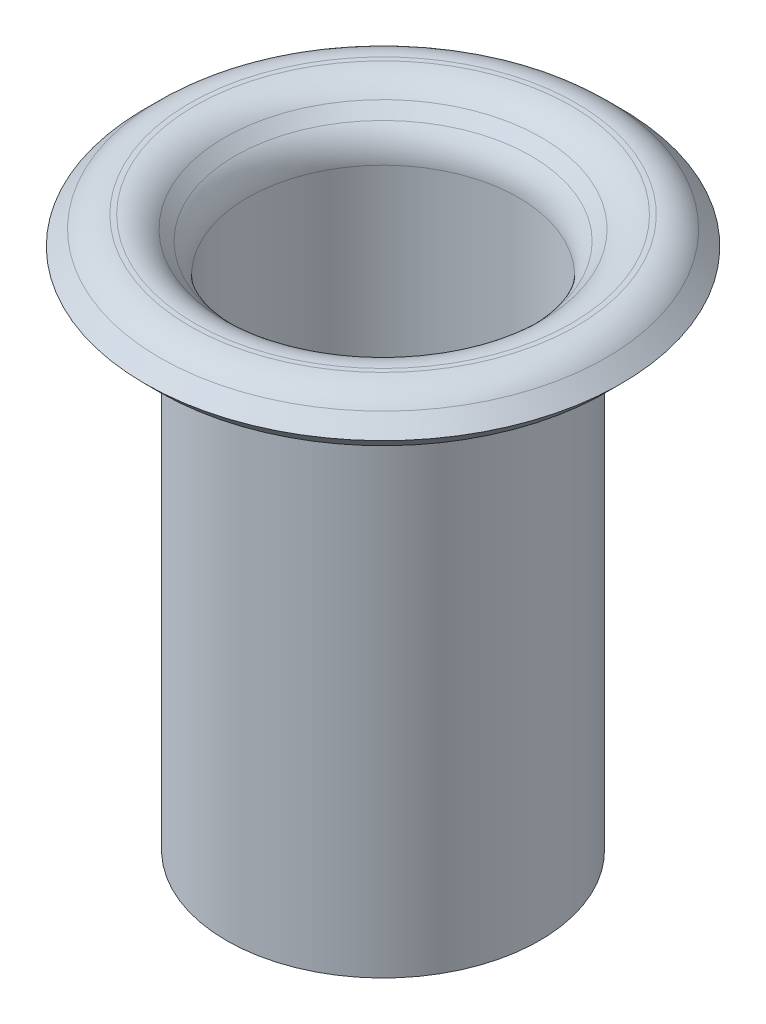
ISO-10303-21;
HEADER;
FILE_DESCRIPTION(('STEP AP214'),'2;1');
FILE_NAME('part.step','',(''),(''),'','','');
FILE_SCHEMA(('AUTOMOTIVE_DESIGN { 1 0 10303 214 1 1 1 1 }'));
ENDSEC;
DATA;
#1=APPLICATION_CONTEXT('core data for automotive mechanical design processes');
#2=APPLICATION_PROTOCOL_DEFINITION('international standard','automotive_design',2000,#1);
#3=PRODUCT_CONTEXT('',#1,'mechanical');
#4=PRODUCT('Part','Part','',(#3));
#5=PRODUCT_RELATED_PRODUCT_CATEGORY('part','',(#4));
#6=PRODUCT_DEFINITION_FORMATION('','',#4);
#7=PRODUCT_DEFINITION_CONTEXT('part definition',#1,'design');
#8=PRODUCT_DEFINITION('design','',#6,#7);
#9=PRODUCT_DEFINITION_SHAPE('','',#8);
#10=(LENGTH_UNIT() NAMED_UNIT(*) SI_UNIT(.MILLI.,.METRE.));
#11=(NAMED_UNIT(*) PLANE_ANGLE_UNIT() SI_UNIT($,.RADIAN.));
#12=(NAMED_UNIT(*) SI_UNIT($,.STERADIAN.) SOLID_ANGLE_UNIT());
#13=UNCERTAINTY_MEASURE_WITH_UNIT(LENGTH_MEASURE(1.E-05),#10,'distance_accuracy_value','');
#14=(GEOMETRIC_REPRESENTATION_CONTEXT(3) GLOBAL_UNCERTAINTY_ASSIGNED_CONTEXT((#13)) GLOBAL_UNIT_ASSIGNED_CONTEXT((#10,
#11,#12)) REPRESENTATION_CONTEXT('',''));
#15=CARTESIAN_POINT('',(0.,0.,0.));
#16=DIRECTION('',(0.,0.,1.));
#17=DIRECTION('',(1.,0.,0.));
#18=AXIS2_PLACEMENT_3D('',#15,#16,#17);
#19=CARTESIAN_POINT('',(-1.28,-5.2,0.));
#20=DIRECTION('',(0.,-1.,0.));
#21=DIRECTION('',(0.,0.,-1.));
#22=AXIS2_PLACEMENT_3D('',#19,#20,#21);
#23=PLANE('',#22);
#24=CARTESIAN_POINT('',(0.,-5.2,0.));
#25=DIRECTION('',(0.,1.,0.));
#26=DIRECTION('',(0.,0.,1.));
#27=AXIS2_PLACEMENT_3D('',#24,#25,#26);
#28=CIRCLE('',#27,1.28);
#29=CARTESIAN_POINT('',(0.,-5.2,1.28));
#30=VERTEX_POINT('',#29);
#31=EDGE_CURVE('E82',#30,#30,#28,.T.);
#32=ORIENTED_EDGE('',*,*,#31,.T.);
#33=EDGE_LOOP('',(#32));
#34=FACE_BOUND('',#33,.T.);
#35=CARTESIAN_POINT('',(0.,-5.2,0.));
#36=DIRECTION('',(0.,1.,0.));
#37=DIRECTION('',(0.,0.,1.));
#38=AXIS2_PLACEMENT_3D('',#35,#36,#37);
#39=CIRCLE('',#38,1.48);
#40=CARTESIAN_POINT('',(0.,-5.2,1.48));
#41=VERTEX_POINT('',#40);
#42=EDGE_CURVE('E10',#41,#41,#39,.T.);
#43=ORIENTED_EDGE('',*,*,#42,.F.);
#44=EDGE_LOOP('',(#43));
#45=FACE_BOUND('',#44,.T.);
#46=ADVANCED_FACE('F30',(#34,#45),#23,.T.);
#47=CARTESIAN_POINT('',(0.,0.,0.));
#48=DIRECTION('',(0.,1.,0.));
#49=DIRECTION('',(0.,0.,1.));
#50=AXIS2_PLACEMENT_3D('',#47,#48,#49);
#51=CYLINDRICAL_SURFACE('',#50,1.48);
#52=ORIENTED_EDGE('',*,*,#42,.T.);
#53=EDGE_LOOP('',(#52));
#54=FACE_BOUND('',#53,.T.);
#55=CARTESIAN_POINT('',(0.,-0.5,0.));
#56=DIRECTION('',(0.,1.,0.));
#57=DIRECTION('',(0.,0.,1.));
#58=AXIS2_PLACEMENT_3D('',#55,#56,#57);
#59=CIRCLE('',#58,1.48);
#60=CARTESIAN_POINT('',(0.,-0.5,1.48));
#61=VERTEX_POINT('',#60);
#62=EDGE_CURVE('E36',#61,#61,#59,.T.);
#63=ORIENTED_EDGE('',*,*,#62,.F.);
#64=EDGE_LOOP('',(#63));
#65=FACE_BOUND('',#64,.T.);
#66=ADVANCED_FACE('F100',(#54,#65),#51,.T.);
#67=CARTESIAN_POINT('',(0.,-0.5,0.));
#68=DIRECTION('',(0.,1.,0.));
#69=DIRECTION('',(0.,0.,1.));
#70=AXIS2_PLACEMENT_3D('',#67,#68,#69);
#71=TOROIDAL_SURFACE('',#70,1.68,0.2);
#72=ORIENTED_EDGE('',*,*,#62,.T.);
#73=EDGE_LOOP('',(#72));
#74=FACE_BOUND('',#73,.T.);
#75=CARTESIAN_POINT('',(0.,-0.35857864376269,0.));
#76=DIRECTION('',(0.,1.,0.));
#77=DIRECTION('',(0.,0.,1.));
#78=AXIS2_PLACEMENT_3D('',#75,#76,#77);
#79=CIRCLE('',#78,1.53857864376269);
#80=CARTESIAN_POINT('',(0.,-0.35857864376269,1.53857864376269));
#81=VERTEX_POINT('',#80);
#82=EDGE_CURVE('E40',#81,#81,#79,.T.);
#83=ORIENTED_EDGE('',*,*,#82,.F.);
#84=EDGE_LOOP('',(#83));
#85=FACE_BOUND('',#84,.T.);
#86=ADVANCED_FACE('F104',(#74,#85),#71,.F.);
#87=CARTESIAN_POINT('',(0.,-0.25857864376269,0.));
#88=DIRECTION('',(0.,1.,0.));
#89=DIRECTION('',(0.,0.,1.));
#90=AXIS2_PLACEMENT_3D('',#87,#88,#89);
#91=CONICAL_SURFACE('',#90,1.63857864376269,0.78539816339745);
#92=ORIENTED_EDGE('',*,*,#82,.T.);
#93=EDGE_LOOP('',(#92));
#94=FACE_BOUND('',#93,.T.);
#95=CARTESIAN_POINT('',(0.,-0.25857864376269,0.));
#96=DIRECTION('',(0.,1.,0.));
#97=DIRECTION('',(0.,0.,1.));
#98=AXIS2_PLACEMENT_3D('',#95,#96,#97);
#99=CIRCLE('',#98,1.63857864376269);
#100=CARTESIAN_POINT('',(0.,-0.25857864376269,1.63857864376269));
#101=VERTEX_POINT('',#100);
#102=EDGE_CURVE('E44',#101,#101,#99,.T.);
#103=ORIENTED_EDGE('',*,*,#102,.F.);
#104=EDGE_LOOP('',(#103));
#105=FACE_BOUND('',#104,.T.);
#106=ADVANCED_FACE('F108',(#94,#105),#91,.T.);
#107=CARTESIAN_POINT('',(0.,-0.4,0.));
#108=DIRECTION('',(0.,1.,0.));
#109=DIRECTION('',(0.,0.,1.));
#110=AXIS2_PLACEMENT_3D('',#107,#108,#109);
#111=TOROIDAL_SURFACE('',#110,1.78,0.2);
#112=ORIENTED_EDGE('',*,*,#102,.T.);
#113=EDGE_LOOP('',(#112));
#114=FACE_BOUND('',#113,.T.);
#115=CARTESIAN_POINT('',(0.,-0.2,0.));
#116=DIRECTION('',(0.,1.,0.));
#117=DIRECTION('',(0.,0.,1.));
#118=AXIS2_PLACEMENT_3D('',#115,#116,#117);
#119=CIRCLE('',#118,1.78);
#120=CARTESIAN_POINT('',(0.,-0.2,1.78));
#121=VERTEX_POINT('',#120);
#122=EDGE_CURVE('E49',#121,#121,#119,.T.);
#123=ORIENTED_EDGE('',*,*,#122,.F.);
#124=EDGE_LOOP('',(#123));
#125=FACE_BOUND('',#124,.T.);
#126=ADVANCED_FACE('F114',(#114,#125),#111,.F.);
#127=CARTESIAN_POINT('',(-1.82573593128807,-0.2,0.));
#128=DIRECTION('',(0.,-1.,0.));
#129=DIRECTION('',(0.,0.,-1.));
#130=AXIS2_PLACEMENT_3D('',#127,#128,#129);
#131=PLANE('',#130);
#132=ORIENTED_EDGE('',*,*,#122,.T.);
#133=EDGE_LOOP('',(#132));
#134=FACE_BOUND('',#133,.T.);
#135=CARTESIAN_POINT('',(0.,-0.2,0.));
#136=DIRECTION('',(0.,1.,0.));
#137=DIRECTION('',(0.,0.,1.));
#138=AXIS2_PLACEMENT_3D('',#135,#136,#137);
#139=CIRCLE('',#138,1.82573593128807);
#140=CARTESIAN_POINT('',(0.,-0.2,1.82573593128807));
#141=VERTEX_POINT('',#140);
#142=EDGE_CURVE('E52',#141,#141,#139,.T.);
#143=ORIENTED_EDGE('',*,*,#142,.F.);
#144=EDGE_LOOP('',(#143));
#145=FACE_BOUND('',#144,.T.);
#146=ADVANCED_FACE('F118',(#134,#145),#131,.T.);
#147=CARTESIAN_POINT('',(0.,-0.4,0.));
#148=DIRECTION('',(0.,1.,0.));
#149=DIRECTION('',(0.,0.,1.));
#150=AXIS2_PLACEMENT_3D('',#147,#148,#149);
#151=TOROIDAL_SURFACE('',#150,1.82573593128807,0.2);
#152=ORIENTED_EDGE('',*,*,#142,.T.);
#153=EDGE_LOOP('',(#152));
#154=FACE_BOUND('',#153,.T.);
#155=CARTESIAN_POINT('',(0.,-0.258578643762691,0.));
#156=DIRECTION('',(0.,1.,0.));
#157=DIRECTION('',(0.,0.,1.));
#158=AXIS2_PLACEMENT_3D('',#155,#156,#157);
#159=CIRCLE('',#158,1.96715728752538);
#160=CARTESIAN_POINT('',(0.,-0.258578643762691,1.96715728752538));
#161=VERTEX_POINT('',#160);
#162=EDGE_CURVE('E55',#161,#161,#159,.T.);
#163=ORIENTED_EDGE('',*,*,#162,.F.);
#164=EDGE_LOOP('',(#163));
#165=FACE_BOUND('',#164,.T.);
#166=ADVANCED_FACE('F122',(#154,#165),#151,.F.);
#167=CARTESIAN_POINT('',(0.,-0.4,0.));
#168=DIRECTION('',(0.,-1.,0.));
#169=DIRECTION('',(0.,0.,-1.));
#170=AXIS2_PLACEMENT_3D('',#167,#168,#169);
#171=CONICAL_SURFACE('',#170,2.10857864376269,0.785398163397447);
#172=ORIENTED_EDGE('',*,*,#162,.T.);
#173=EDGE_LOOP('',(#172));
#174=FACE_BOUND('',#173,.T.);
#175=CARTESIAN_POINT('',(0.,-0.4,0.));
#176=DIRECTION('',(0.,1.,0.));
#177=DIRECTION('',(0.,0.,1.));
#178=AXIS2_PLACEMENT_3D('',#175,#176,#177);
#179=CIRCLE('',#178,2.10857864376269);
#180=CARTESIAN_POINT('',(0.,-0.4,2.10857864376269));
#181=VERTEX_POINT('',#180);
#182=EDGE_CURVE('E58',#181,#181,#179,.T.);
#183=ORIENTED_EDGE('',*,*,#182,.F.);
#184=EDGE_LOOP('',(#183));
#185=FACE_BOUND('',#184,.T.);
#186=ADVANCED_FACE('F126',(#174,#185),#171,.F.);
#187=CARTESIAN_POINT('',(0.,-0.258578643762691,0.));
#188=DIRECTION('',(0.,1.,0.));
#189=DIRECTION('',(0.,0.,1.));
#190=AXIS2_PLACEMENT_3D('',#187,#188,#189);
#191=CONICAL_SURFACE('',#190,2.25,0.78539816339745);
#192=ORIENTED_EDGE('',*,*,#182,.T.);
#193=EDGE_LOOP('',(#192));
#194=FACE_BOUND('',#193,.T.);
#195=CARTESIAN_POINT('',(0.,-0.258578643762691,0.));
#196=DIRECTION('',(0.,1.,0.));
#197=DIRECTION('',(0.,0.,1.));
#198=AXIS2_PLACEMENT_3D('',#195,#196,#197);
#199=CIRCLE('',#198,2.25);
#200=CARTESIAN_POINT('',(0.,-0.258578643762691,2.25));
#201=VERTEX_POINT('',#200);
#202=EDGE_CURVE('E61',#201,#201,#199,.T.);
#203=ORIENTED_EDGE('',*,*,#202,.F.);
#204=EDGE_LOOP('',(#203));
#205=FACE_BOUND('',#204,.T.);
#206=ADVANCED_FACE('F130',(#194,#205),#191,.T.);
#207=CARTESIAN_POINT('',(0.,-0.117157287525382,0.));
#208=DIRECTION('',(0.,-1.,0.));
#209=DIRECTION('',(0.,0.,-1.));
#210=AXIS2_PLACEMENT_3D('',#207,#208,#209);
#211=CONICAL_SURFACE('',#210,2.10857864376269,0.78539816339745);
#212=ORIENTED_EDGE('',*,*,#202,.T.);
#213=EDGE_LOOP('',(#212));
#214=FACE_BOUND('',#213,.T.);
#215=CARTESIAN_POINT('',(0.,-0.117157287525382,0.));
#216=DIRECTION('',(0.,1.,0.));
#217=DIRECTION('',(0.,0.,1.));
#218=AXIS2_PLACEMENT_3D('',#215,#216,#217);
#219=CIRCLE('',#218,2.10857864376269);
#220=CARTESIAN_POINT('',(0.,-0.117157287525382,2.10857864376269));
#221=VERTEX_POINT('',#220);
#222=EDGE_CURVE('E64',#221,#221,#219,.T.);
#223=ORIENTED_EDGE('',*,*,#222,.F.);
#224=EDGE_LOOP('',(#223));
#225=FACE_BOUND('',#224,.T.);
#226=ADVANCED_FACE('F134',(#214,#225),#211,.T.);
#227=CARTESIAN_POINT('',(0.,-0.4,0.));
#228=DIRECTION('',(0.,1.,0.));
#229=DIRECTION('',(0.,0.,1.));
#230=AXIS2_PLACEMENT_3D('',#227,#228,#229);
#231=TOROIDAL_SURFACE('',#230,1.82573593128807,0.4);
#232=ORIENTED_EDGE('',*,*,#222,.T.);
#233=EDGE_LOOP('',(#232));
#234=FACE_BOUND('',#233,.T.);
#235=CARTESIAN_POINT('',(0.,0.,0.));
#236=DIRECTION('',(0.,1.,0.));
#237=DIRECTION('',(0.,0.,1.));
#238=AXIS2_PLACEMENT_3D('',#235,#236,#237);
#239=CIRCLE('',#238,1.82573593128807);
#240=CARTESIAN_POINT('',(0.,0.,1.82573593128807));
#241=VERTEX_POINT('',#240);
#242=EDGE_CURVE('E67',#241,#241,#239,.T.);
#243=ORIENTED_EDGE('',*,*,#242,.F.);
#244=EDGE_LOOP('',(#243));
#245=FACE_BOUND('',#244,.T.);
#246=ADVANCED_FACE('F138',(#234,#245),#231,.T.);
#247=CARTESIAN_POINT('',(-1.82573593128807,0.,0.));
#248=DIRECTION('',(0.,1.,0.));
#249=DIRECTION('',(0.,0.,1.));
#250=AXIS2_PLACEMENT_3D('',#247,#248,#249);
#251=PLANE('',#250);
#252=ORIENTED_EDGE('',*,*,#242,.T.);
#253=EDGE_LOOP('',(#252));
#254=FACE_BOUND('',#253,.T.);
#255=CARTESIAN_POINT('',(0.,0.,0.));
#256=DIRECTION('',(0.,1.,0.));
#257=DIRECTION('',(0.,0.,1.));
#258=AXIS2_PLACEMENT_3D('',#255,#256,#257);
#259=CIRCLE('',#258,1.78);
#260=CARTESIAN_POINT('',(0.,0.,1.78));
#261=VERTEX_POINT('',#260);
#262=EDGE_CURVE('E70',#261,#261,#259,.T.);
#263=ORIENTED_EDGE('',*,*,#262,.F.);
#264=EDGE_LOOP('',(#263));
#265=FACE_BOUND('',#264,.T.);
#266=ADVANCED_FACE('F142',(#254,#265),#251,.T.);
#267=CARTESIAN_POINT('',(0.,-0.4,0.));
#268=DIRECTION('',(0.,1.,0.));
#269=DIRECTION('',(0.,0.,1.));
#270=AXIS2_PLACEMENT_3D('',#267,#268,#269);
#271=TOROIDAL_SURFACE('',#270,1.78,0.4);
#272=ORIENTED_EDGE('',*,*,#262,.T.);
#273=EDGE_LOOP('',(#272));
#274=FACE_BOUND('',#273,.T.);
#275=CARTESIAN_POINT('',(0.,-0.117157287525381,0.));
#276=DIRECTION('',(0.,1.,0.));
#277=DIRECTION('',(0.,0.,1.));
#278=AXIS2_PLACEMENT_3D('',#275,#276,#277);
#279=CIRCLE('',#278,1.49715728752538);
#280=CARTESIAN_POINT('',(0.,-0.117157287525381,1.49715728752538));
#281=VERTEX_POINT('',#280);
#282=EDGE_CURVE('E73',#281,#281,#279,.T.);
#283=ORIENTED_EDGE('',*,*,#282,.F.);
#284=EDGE_LOOP('',(#283));
#285=FACE_BOUND('',#284,.T.);
#286=ADVANCED_FACE('F146',(#274,#285),#271,.T.);
#287=CARTESIAN_POINT('',(0.,-0.217157287525381,0.));
#288=DIRECTION('',(0.,1.,0.));
#289=DIRECTION('',(0.,0.,1.));
#290=AXIS2_PLACEMENT_3D('',#287,#288,#289);
#291=CONICAL_SURFACE('',#290,1.39715728752538,0.785398163397451);
#292=ORIENTED_EDGE('',*,*,#282,.T.);
#293=EDGE_LOOP('',(#292));
#294=FACE_BOUND('',#293,.T.);
#295=CARTESIAN_POINT('',(0.,-0.217157287525381,0.));
#296=DIRECTION('',(0.,1.,0.));
#297=DIRECTION('',(0.,0.,1.));
#298=AXIS2_PLACEMENT_3D('',#295,#296,#297);
#299=CIRCLE('',#298,1.39715728752538);
#300=CARTESIAN_POINT('',(0.,-0.217157287525381,1.39715728752538));
#301=VERTEX_POINT('',#300);
#302=EDGE_CURVE('E76',#301,#301,#299,.T.);
#303=ORIENTED_EDGE('',*,*,#302,.F.);
#304=EDGE_LOOP('',(#303));
#305=FACE_BOUND('',#304,.T.);
#306=ADVANCED_FACE('F96',(#294,#305),#291,.F.);
#307=CARTESIAN_POINT('',(0.,-0.5,0.));
#308=DIRECTION('',(0.,1.,0.));
#309=DIRECTION('',(0.,0.,1.));
#310=AXIS2_PLACEMENT_3D('',#307,#308,#309);
#311=TOROIDAL_SURFACE('',#310,1.68,0.4);
#312=ORIENTED_EDGE('',*,*,#302,.T.);
#313=EDGE_LOOP('',(#312));
#314=FACE_BOUND('',#313,.T.);
#315=CARTESIAN_POINT('',(0.,-0.5,0.));
#316=DIRECTION('',(0.,1.,0.));
#317=DIRECTION('',(0.,0.,1.));
#318=AXIS2_PLACEMENT_3D('',#315,#316,#317);
#319=CIRCLE('',#318,1.28);
#320=CARTESIAN_POINT('',(0.,-0.5,1.28));
#321=VERTEX_POINT('',#320);
#322=EDGE_CURVE('E79',#321,#321,#319,.T.);
#323=ORIENTED_EDGE('',*,*,#322,.F.);
#324=EDGE_LOOP('',(#323));
#325=FACE_BOUND('',#324,.T.);
#326=ADVANCED_FACE('F90',(#314,#325),#311,.T.);
#327=CARTESIAN_POINT('',(0.,0.,0.));
#328=DIRECTION('',(0.,1.,0.));
#329=DIRECTION('',(0.,0.,1.));
#330=AXIS2_PLACEMENT_3D('',#327,#328,#329);
#331=CYLINDRICAL_SURFACE('',#330,1.28);
#332=ORIENTED_EDGE('',*,*,#322,.T.);
#333=EDGE_LOOP('',(#332));
#334=FACE_BOUND('',#333,.T.);
#335=ORIENTED_EDGE('',*,*,#31,.F.);
#336=EDGE_LOOP('',(#335));
#337=FACE_BOUND('',#336,.T.);
#338=ADVANCED_FACE('F88',(#334,#337),#331,.F.);
#339=CLOSED_SHELL('',(#46,#66,#86,#106,#126,#146,#166,#186,#206,#226,#246,#266,#286,#306,#326,#338));
#340=MANIFOLD_SOLID_BREP('B2',#339);
#341=ADVANCED_BREP_SHAPE_REPRESENTATION('',(#18,#340),#14);
#342=SHAPE_DEFINITION_REPRESENTATION(#9,#341);
ENDSEC;
END-ISO-10303-21;
